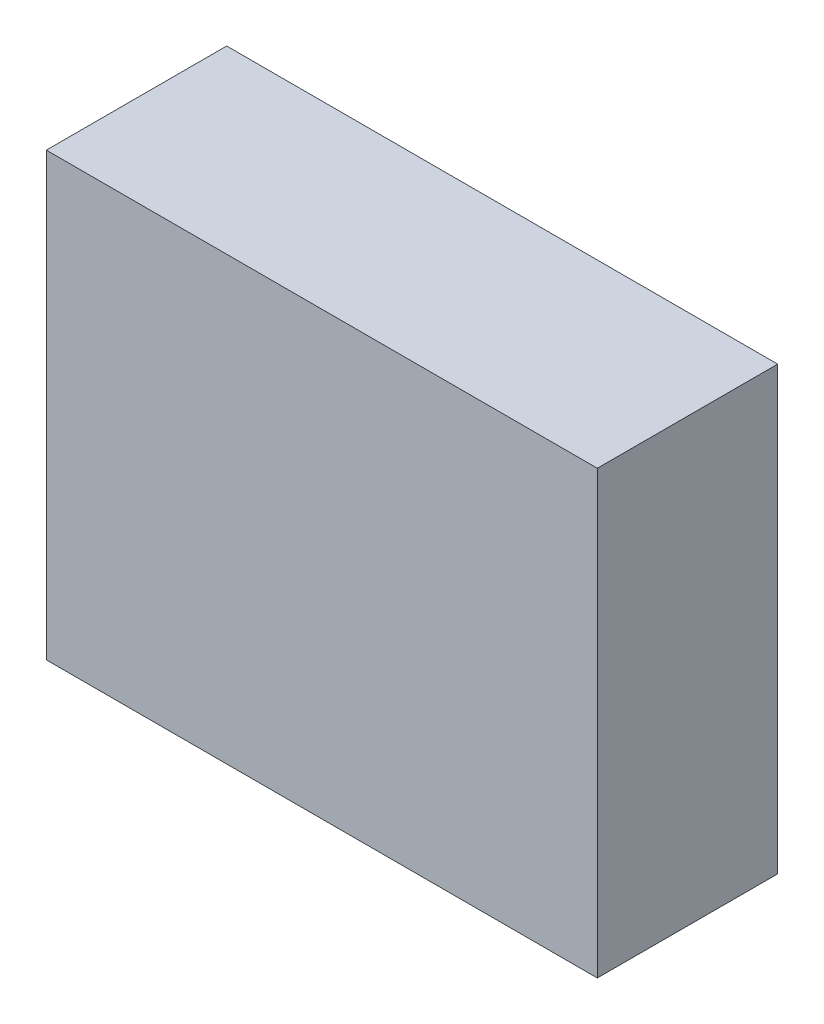
ISO-10303-21;
HEADER;
FILE_DESCRIPTION(('STEP AP214'),'2;1');
FILE_NAME('part.step','',(''),(''),'','','');
FILE_SCHEMA(('AUTOMOTIVE_DESIGN { 1 0 10303 214 1 1 1 1 }'));
ENDSEC;
DATA;
#1=APPLICATION_CONTEXT('core data for automotive mechanical design processes');
#2=APPLICATION_PROTOCOL_DEFINITION('international standard','automotive_design',2000,#1);
#3=PRODUCT_CONTEXT('',#1,'mechanical');
#4=PRODUCT('Part','Part','',(#3));
#5=PRODUCT_RELATED_PRODUCT_CATEGORY('part','',(#4));
#6=PRODUCT_DEFINITION_FORMATION('','',#4);
#7=PRODUCT_DEFINITION_CONTEXT('part definition',#1,'design');
#8=PRODUCT_DEFINITION('design','',#6,#7);
#9=PRODUCT_DEFINITION_SHAPE('','',#8);
#10=(LENGTH_UNIT() NAMED_UNIT(*) SI_UNIT(.MILLI.,.METRE.));
#11=(NAMED_UNIT(*) PLANE_ANGLE_UNIT() SI_UNIT($,.RADIAN.));
#12=(NAMED_UNIT(*) SI_UNIT($,.STERADIAN.) SOLID_ANGLE_UNIT());
#13=UNCERTAINTY_MEASURE_WITH_UNIT(LENGTH_MEASURE(1.E-05),#10,'distance_accuracy_value','');
#14=(GEOMETRIC_REPRESENTATION_CONTEXT(3) GLOBAL_UNCERTAINTY_ASSIGNED_CONTEXT((#13)) GLOBAL_UNIT_ASSIGNED_CONTEXT((#10,
#11,#12)) REPRESENTATION_CONTEXT('',''));
#15=CARTESIAN_POINT('',(0.,0.,0.));
#16=DIRECTION('',(0.,0.,1.));
#17=DIRECTION('',(1.,0.,0.));
#18=AXIS2_PLACEMENT_3D('',#15,#16,#17);
#19=CARTESIAN_POINT('',(2.4900001,-1.99499982,1.63));
#20=DIRECTION('',(0.,0.,1.));
#21=DIRECTION('',(1.,0.,0.));
#22=AXIS2_PLACEMENT_3D('',#19,#20,#21);
#23=PLANE('',#22);
#24=DIRECTION('',(0.,1.,0.));
#25=VECTOR('',#24,1.);
#26=CARTESIAN_POINT('',(-2.4900001,-1.99499982,1.63));
#27=LINE('',#26,#25);
#28=CARTESIAN_POINT('',(-2.4900001,-1.99499982,1.63));
#29=VERTEX_POINT('',#28);
#30=CARTESIAN_POINT('',(-2.4900001,1.99499982,1.63));
#31=VERTEX_POINT('',#30);
#32=EDGE_CURVE('E52',#29,#31,#27,.T.);
#33=ORIENTED_EDGE('',*,*,#32,.F.);
#34=DIRECTION('',(1.,0.,0.));
#35=VECTOR('',#34,1.);
#36=CARTESIAN_POINT('',(2.4900001,-1.99499982,1.63));
#37=LINE('',#36,#35);
#38=CARTESIAN_POINT('',(2.4900001,-1.99499982,1.63));
#39=VERTEX_POINT('',#38);
#40=EDGE_CURVE('E67',#39,#29,#37,.F.);
#41=ORIENTED_EDGE('',*,*,#40,.F.);
#42=DIRECTION('',(0.,1.,0.));
#43=VECTOR('',#42,1.);
#44=CARTESIAN_POINT('',(2.4900001,1.99499982,1.63));
#45=LINE('',#44,#43);
#46=CARTESIAN_POINT('',(2.4900001,1.99499982,1.63));
#47=VERTEX_POINT('',#46);
#48=EDGE_CURVE('E19',#47,#39,#45,.F.);
#49=ORIENTED_EDGE('',*,*,#48,.F.);
#50=DIRECTION('',(1.,0.,0.));
#51=VECTOR('',#50,1.);
#52=CARTESIAN_POINT('',(-2.4900001,1.99499982,1.63));
#53=LINE('',#52,#51);
#54=EDGE_CURVE('E57',#31,#47,#53,.T.);
#55=ORIENTED_EDGE('',*,*,#54,.F.);
#56=EDGE_LOOP('',(#33,#41,#49,#55));
#57=FACE_BOUND('',#56,.T.);
#58=ADVANCED_FACE('F16',(#57),#23,.T.);
#59=CARTESIAN_POINT('',(2.4900001,1.99499982,0.));
#60=DIRECTION('',(1.,0.,0.));
#61=DIRECTION('',(0.,0.,-1.));
#62=AXIS2_PLACEMENT_3D('',#59,#60,#61);
#63=PLANE('',#62);
#64=DIRECTION('',(0.,0.,-1.));
#65=VECTOR('',#64,1.);
#66=CARTESIAN_POINT('',(2.4900001,-1.99499982,0.));
#67=LINE('',#66,#65);
#68=CARTESIAN_POINT('',(2.4900001,-1.99499982,0.));
#69=VERTEX_POINT('',#68);
#70=EDGE_CURVE('E78',#69,#39,#67,.F.);
#71=ORIENTED_EDGE('',*,*,#70,.F.);
#72=DIRECTION('',(0.,1.,0.));
#73=VECTOR('',#72,1.);
#74=CARTESIAN_POINT('',(2.4900001,-1.99499982,0.));
#75=LINE('',#74,#73);
#76=CARTESIAN_POINT('',(2.4900001,1.99499982,0.));
#77=VERTEX_POINT('',#76);
#78=EDGE_CURVE('E73',#69,#77,#75,.T.);
#79=ORIENTED_EDGE('',*,*,#78,.T.);
#80=DIRECTION('',(0.,0.,1.));
#81=VECTOR('',#80,1.);
#82=CARTESIAN_POINT('',(2.4900001,1.99499982,0.));
#83=LINE('',#82,#81);
#84=EDGE_CURVE('E62',#47,#77,#83,.F.);
#85=ORIENTED_EDGE('',*,*,#84,.F.);
#86=ORIENTED_EDGE('',*,*,#48,.T.);
#87=EDGE_LOOP('',(#71,#79,#85,#86));
#88=FACE_BOUND('',#87,.T.);
#89=ADVANCED_FACE('F72',(#88),#63,.T.);
#90=CARTESIAN_POINT('',(-2.4900001,1.99499982,0.));
#91=DIRECTION('',(0.,1.,0.));
#92=DIRECTION('',(0.,0.,1.));
#93=AXIS2_PLACEMENT_3D('',#90,#91,#92);
#94=PLANE('',#93);
#95=ORIENTED_EDGE('',*,*,#84,.T.);
#96=DIRECTION('',(1.,0.,0.));
#97=VECTOR('',#96,1.);
#98=CARTESIAN_POINT('',(2.4900001,1.99499982,0.));
#99=LINE('',#98,#97);
#100=CARTESIAN_POINT('',(-2.4900001,1.99499982,0.));
#101=VERTEX_POINT('',#100);
#102=EDGE_CURVE('E83',#77,#101,#99,.F.);
#103=ORIENTED_EDGE('',*,*,#102,.T.);
#104=DIRECTION('',(0.,0.,1.));
#105=VECTOR('',#104,1.);
#106=CARTESIAN_POINT('',(-2.4900001,1.99499982,0.));
#107=LINE('',#106,#105);
#108=EDGE_CURVE('E64',#31,#101,#107,.F.);
#109=ORIENTED_EDGE('',*,*,#108,.F.);
#110=ORIENTED_EDGE('',*,*,#54,.T.);
#111=EDGE_LOOP('',(#95,#103,#109,#110));
#112=FACE_BOUND('',#111,.T.);
#113=ADVANCED_FACE('F59',(#112),#94,.T.);
#114=CARTESIAN_POINT('',(-2.4900001,-1.99499982,0.));
#115=DIRECTION('',(-1.,0.,0.));
#116=DIRECTION('',(0.,0.,1.));
#117=AXIS2_PLACEMENT_3D('',#114,#115,#116);
#118=PLANE('',#117);
#119=ORIENTED_EDGE('',*,*,#108,.T.);
#120=DIRECTION('',(0.,1.,0.));
#121=VECTOR('',#120,1.);
#122=CARTESIAN_POINT('',(-2.4900001,-1.99499982,0.));
#123=LINE('',#122,#121);
#124=CARTESIAN_POINT('',(-2.4900001,-1.99499982,0.));
#125=VERTEX_POINT('',#124);
#126=EDGE_CURVE('E25',#101,#125,#123,.F.);
#127=ORIENTED_EDGE('',*,*,#126,.T.);
#128=DIRECTION('',(0.,0.,-1.));
#129=VECTOR('',#128,1.);
#130=CARTESIAN_POINT('',(-2.4900001,-1.99499982,0.));
#131=LINE('',#130,#129);
#132=EDGE_CURVE('E33',#29,#125,#131,.T.);
#133=ORIENTED_EDGE('',*,*,#132,.F.);
#134=ORIENTED_EDGE('',*,*,#32,.T.);
#135=EDGE_LOOP('',(#119,#127,#133,#134));
#136=FACE_BOUND('',#135,.T.);
#137=ADVANCED_FACE('F87',(#136),#118,.T.);
#138=CARTESIAN_POINT('',(2.4900001,-1.99499982,0.));
#139=DIRECTION('',(0.,-1.,0.));
#140=DIRECTION('',(0.,0.,-1.));
#141=AXIS2_PLACEMENT_3D('',#138,#139,#140);
#142=PLANE('',#141);
#143=ORIENTED_EDGE('',*,*,#132,.T.);
#144=DIRECTION('',(1.,0.,0.));
#145=VECTOR('',#144,1.);
#146=CARTESIAN_POINT('',(2.4900001,-1.99499982,0.));
#147=LINE('',#146,#145);
#148=EDGE_CURVE('E11',#125,#69,#147,.T.);
#149=ORIENTED_EDGE('',*,*,#148,.T.);
#150=ORIENTED_EDGE('',*,*,#70,.T.);
#151=ORIENTED_EDGE('',*,*,#40,.T.);
#152=EDGE_LOOP('',(#143,#149,#150,#151));
#153=FACE_BOUND('',#152,.T.);
#154=ADVANCED_FACE('F90',(#153),#142,.T.);
#155=CARTESIAN_POINT('',(2.4900001,-1.99499982,0.));
#156=DIRECTION('',(0.,0.,1.));
#157=DIRECTION('',(1.,0.,0.));
#158=AXIS2_PLACEMENT_3D('',#155,#156,#157);
#159=PLANE('',#158);
#160=ORIENTED_EDGE('',*,*,#126,.F.);
#161=ORIENTED_EDGE('',*,*,#102,.F.);
#162=ORIENTED_EDGE('',*,*,#78,.F.);
#163=ORIENTED_EDGE('',*,*,#148,.F.);
#164=EDGE_LOOP('',(#160,#161,#162,#163));
#165=FACE_BOUND('',#164,.T.);
#166=ADVANCED_FACE('F89',(#165),#159,.F.);
#167=CLOSED_SHELL('',(#58,#89,#113,#137,#154,#166));
#168=MANIFOLD_SOLID_BREP('B1',#167);
#169=ADVANCED_BREP_SHAPE_REPRESENTATION('',(#18,#168),#14);
#170=SHAPE_DEFINITION_REPRESENTATION(#9,#169);
ENDSEC;
END-ISO-10303-21;
